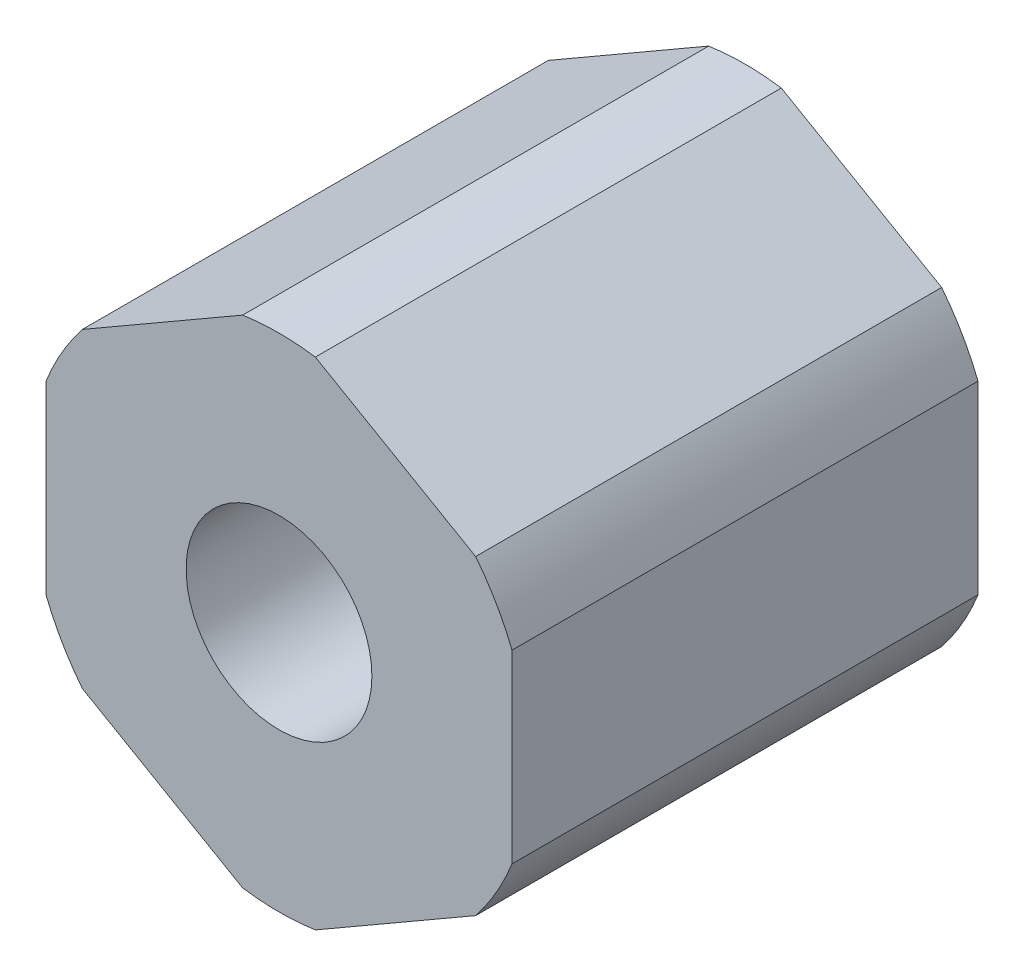
ISO-10303-21;
HEADER;
FILE_DESCRIPTION(('STEP AP214'),'2;1');
FILE_NAME('part.step','',(''),(''),'','','');
FILE_SCHEMA(('AUTOMOTIVE_DESIGN { 1 0 10303 214 1 1 1 1 }'));
ENDSEC;
DATA;
#1=APPLICATION_CONTEXT('core data for automotive mechanical design processes');
#2=APPLICATION_PROTOCOL_DEFINITION('international standard','automotive_design',2000,#1);
#3=PRODUCT_CONTEXT('',#1,'mechanical');
#4=PRODUCT('Part','Part','',(#3));
#5=PRODUCT_RELATED_PRODUCT_CATEGORY('part','',(#4));
#6=PRODUCT_DEFINITION_FORMATION('','',#4);
#7=PRODUCT_DEFINITION_CONTEXT('part definition',#1,'design');
#8=PRODUCT_DEFINITION('design','',#6,#7);
#9=PRODUCT_DEFINITION_SHAPE('','',#8);
#10=(LENGTH_UNIT() NAMED_UNIT(*) SI_UNIT(.MILLI.,.METRE.));
#11=(NAMED_UNIT(*) PLANE_ANGLE_UNIT() SI_UNIT($,.RADIAN.));
#12=(NAMED_UNIT(*) SI_UNIT($,.STERADIAN.) SOLID_ANGLE_UNIT());
#13=UNCERTAINTY_MEASURE_WITH_UNIT(LENGTH_MEASURE(1.E-05),#10,'distance_accuracy_value','');
#14=(GEOMETRIC_REPRESENTATION_CONTEXT(3) GLOBAL_UNCERTAINTY_ASSIGNED_CONTEXT((#13)) GLOBAL_UNIT_ASSIGNED_CONTEXT((#10,
#11,#12)) REPRESENTATION_CONTEXT('',''));
#15=CARTESIAN_POINT('',(0.,0.,0.));
#16=DIRECTION('',(0.,0.,1.));
#17=DIRECTION('',(1.,0.,0.));
#18=AXIS2_PLACEMENT_3D('',#15,#16,#17);
#19=CARTESIAN_POINT('',(0.,0.,4.7625));
#20=DIRECTION('',(0.,0.,1.));
#21=DIRECTION('',(1.,0.,0.));
#22=AXIS2_PLACEMENT_3D('',#19,#20,#21);
#23=PLANE('',#22);
#24=CARTESIAN_POINT('',(0.,0.,4.7625));
#25=DIRECTION('',(0.,0.,1.));
#26=DIRECTION('',(1.,0.,0.));
#27=AXIS2_PLACEMENT_3D('',#24,#25,#26);
#28=CIRCLE('',#27,1.89865);
#29=CARTESIAN_POINT('',(1.89865,0.,4.7625));
#30=VERTEX_POINT('',#29);
#31=EDGE_CURVE('E255',#30,#30,#28,.T.);
#32=ORIENTED_EDGE('',*,*,#31,.F.);
#33=EDGE_LOOP('',(#32));
#34=FACE_BOUND('',#33,.T.);
#35=CARTESIAN_POINT('',(0.,0.,4.7625));
#36=DIRECTION('',(0.,0.,1.));
#37=DIRECTION('',(1.,0.,0.));
#38=AXIS2_PLACEMENT_3D('',#35,#36,#37);
#39=CIRCLE('',#38,5.12445);
#40=CARTESIAN_POINT('',(4.01952231081252,-3.17858902586987,4.7625));
#41=VERTEX_POINT('',#40);
#42=CARTESIAN_POINT('',(4.7625,-1.89171391930704,4.7625));
#43=VERTEX_POINT('',#42);
#44=EDGE_CURVE('E138',#41,#43,#39,.T.);
#45=ORIENTED_EDGE('',*,*,#44,.T.);
#46=DIRECTION('',(0.,1.,0.));
#47=VECTOR('',#46,1.);
#48=CARTESIAN_POINT('',(4.7625,-1.89171391930704,4.7625));
#49=LINE('',#48,#47);
#50=CARTESIAN_POINT('',(4.7625,1.89171391930704,4.7625));
#51=VERTEX_POINT('',#50);
#52=EDGE_CURVE('E132',#43,#51,#49,.T.);
#53=ORIENTED_EDGE('',*,*,#52,.T.);
#54=CARTESIAN_POINT('',(0.,0.,4.7625));
#55=DIRECTION('',(0.,0.,1.));
#56=DIRECTION('',(1.,0.,0.));
#57=AXIS2_PLACEMENT_3D('',#54,#55,#56);
#58=CIRCLE('',#57,5.12445);
#59=CARTESIAN_POINT('',(4.01952231081252,3.17858902586987,4.7625));
#60=VERTEX_POINT('',#59);
#61=EDGE_CURVE('E135',#51,#60,#58,.T.);
#62=ORIENTED_EDGE('',*,*,#61,.T.);
#63=DIRECTION('',(-0.866025403784439,0.499999999999999,0.));
#64=VECTOR('',#63,1.);
#65=CARTESIAN_POINT('',(4.01952231081252,3.17858902586987,4.7625));
#66=LINE('',#65,#64);
#67=CARTESIAN_POINT('',(0.742977689187476,5.07030294517691,4.7625));
#68=VERTEX_POINT('',#67);
#69=EDGE_CURVE('E54',#60,#68,#66,.T.);
#70=ORIENTED_EDGE('',*,*,#69,.T.);
#71=CARTESIAN_POINT('',(0.,0.,4.7625));
#72=DIRECTION('',(0.,0.,1.));
#73=DIRECTION('',(1.,0.,0.));
#74=AXIS2_PLACEMENT_3D('',#71,#72,#73);
#75=CIRCLE('',#74,5.12445);
#76=CARTESIAN_POINT('',(-0.742977689187481,5.07030294517691,4.7625));
#77=VERTEX_POINT('',#76);
#78=EDGE_CURVE('E185',#68,#77,#75,.T.);
#79=ORIENTED_EDGE('',*,*,#78,.T.);
#80=DIRECTION('',(-0.866025403784438,-0.5,0.));
#81=VECTOR('',#80,1.);
#82=CARTESIAN_POINT('',(-0.742977689187481,5.07030294517691,4.7625));
#83=LINE('',#82,#81);
#84=CARTESIAN_POINT('',(-4.01952231081252,3.17858902586987,4.7625));
#85=VERTEX_POINT('',#84);
#86=EDGE_CURVE('E107',#77,#85,#83,.T.);
#87=ORIENTED_EDGE('',*,*,#86,.T.);
#88=CARTESIAN_POINT('',(0.,0.,4.7625));
#89=DIRECTION('',(0.,0.,1.));
#90=DIRECTION('',(1.,0.,0.));
#91=AXIS2_PLACEMENT_3D('',#88,#89,#90);
#92=CIRCLE('',#91,5.12445);
#93=CARTESIAN_POINT('',(-4.7625,1.89171391930704,4.7625));
#94=VERTEX_POINT('',#93);
#95=EDGE_CURVE('E212',#85,#94,#92,.T.);
#96=ORIENTED_EDGE('',*,*,#95,.T.);
#97=DIRECTION('',(0.,-1.,0.));
#98=VECTOR('',#97,1.);
#99=CARTESIAN_POINT('',(-4.7625,1.89171391930704,4.7625));
#100=LINE('',#99,#98);
#101=CARTESIAN_POINT('',(-4.7625,-1.89171391930704,4.7625));
#102=VERTEX_POINT('',#101);
#103=EDGE_CURVE('E226',#94,#102,#100,.T.);
#104=ORIENTED_EDGE('',*,*,#103,.T.);
#105=CARTESIAN_POINT('',(0.,0.,4.7625));
#106=DIRECTION('',(0.,0.,1.));
#107=DIRECTION('',(1.,0.,0.));
#108=AXIS2_PLACEMENT_3D('',#105,#106,#107);
#109=CIRCLE('',#108,5.12445);
#110=CARTESIAN_POINT('',(-4.01952231081252,-3.17858902586987,4.7625));
#111=VERTEX_POINT('',#110);
#112=EDGE_CURVE('E223',#102,#111,#109,.T.);
#113=ORIENTED_EDGE('',*,*,#112,.T.);
#114=DIRECTION('',(0.866025403784439,-0.5,0.));
#115=VECTOR('',#114,1.);
#116=CARTESIAN_POINT('',(-4.01952231081252,-3.17858902586987,4.7625));
#117=LINE('',#116,#115);
#118=CARTESIAN_POINT('',(-0.742977689187477,-5.07030294517691,4.7625));
#119=VERTEX_POINT('',#118);
#120=EDGE_CURVE('E225',#111,#119,#117,.T.);
#121=ORIENTED_EDGE('',*,*,#120,.T.);
#122=CARTESIAN_POINT('',(0.,0.,4.7625));
#123=DIRECTION('',(0.,0.,1.));
#124=DIRECTION('',(1.,0.,0.));
#125=AXIS2_PLACEMENT_3D('',#122,#123,#124);
#126=CIRCLE('',#125,5.12445);
#127=CARTESIAN_POINT('',(0.742977689187474,-5.07030294517691,4.7625));
#128=VERTEX_POINT('',#127);
#129=EDGE_CURVE('E228',#119,#128,#126,.T.);
#130=ORIENTED_EDGE('',*,*,#129,.T.);
#131=DIRECTION('',(0.866025403784439,0.5,0.));
#132=VECTOR('',#131,1.);
#133=CARTESIAN_POINT('',(0.742977689187478,-5.07030294517691,4.7625));
#134=LINE('',#133,#132);
#135=EDGE_CURVE('E234',#128,#41,#134,.T.);
#136=ORIENTED_EDGE('',*,*,#135,.T.);
#137=EDGE_LOOP('',(#45,#53,#62,#70,#79,#87,#96,#104,#113,#121,#130,#136));
#138=FACE_BOUND('',#137,.T.);
#139=ADVANCED_FACE('F38',(#34,#138),#23,.T.);
#140=CARTESIAN_POINT('',(-0.742977689187481,5.07030294517691,4.7625));
#141=DIRECTION('',(0.500000000000001,-0.866025403784438,0.));
#142=DIRECTION('',(0.866025403784438,0.500000000000001,0.));
#143=AXIS2_PLACEMENT_3D('',#140,#141,#142);
#144=PLANE('',#143);
#145=DIRECTION('',(0.,0.,-1.));
#146=VECTOR('',#145,1.);
#147=CARTESIAN_POINT('',(-4.01952231081252,3.17858902586987,4.7625));
#148=LINE('',#147,#146);
#149=CARTESIAN_POINT('',(-4.01952231081252,3.17858902586987,-4.7625));
#150=VERTEX_POINT('',#149);
#151=EDGE_CURVE('E46',#85,#150,#148,.T.);
#152=ORIENTED_EDGE('',*,*,#151,.F.);
#153=ORIENTED_EDGE('',*,*,#86,.F.);
#154=DIRECTION('',(0.,0.,-1.));
#155=VECTOR('',#154,1.);
#156=CARTESIAN_POINT('',(-0.742977689187481,5.07030294517691,4.7625));
#157=LINE('',#156,#155);
#158=CARTESIAN_POINT('',(-0.742977689187481,5.07030294517691,-4.7625));
#159=VERTEX_POINT('',#158);
#160=EDGE_CURVE('E11',#77,#159,#157,.T.);
#161=ORIENTED_EDGE('',*,*,#160,.T.);
#162=DIRECTION('',(-0.866025403784438,-0.5,0.));
#163=VECTOR('',#162,1.);
#164=CARTESIAN_POINT('',(-0.742977689187481,5.07030294517691,-4.7625));
#165=LINE('',#164,#163);
#166=EDGE_CURVE('E160',#159,#150,#165,.T.);
#167=ORIENTED_EDGE('',*,*,#166,.T.);
#168=EDGE_LOOP('',(#152,#153,#161,#167));
#169=FACE_BOUND('',#168,.T.);
#170=ADVANCED_FACE('F262',(#169),#144,.F.);
#171=CARTESIAN_POINT('',(-4.7625,1.89171391930704,4.7625));
#172=DIRECTION('',(1.,0.,0.));
#173=DIRECTION('',(0.,0.,-1.));
#174=AXIS2_PLACEMENT_3D('',#171,#172,#173);
#175=PLANE('',#174);
#176=DIRECTION('',(0.,0.,-1.));
#177=VECTOR('',#176,1.);
#178=CARTESIAN_POINT('',(-4.7625,-1.89171391930704,4.7625));
#179=LINE('',#178,#177);
#180=CARTESIAN_POINT('',(-4.7625,-1.89171391930704,-4.7625));
#181=VERTEX_POINT('',#180);
#182=EDGE_CURVE('E201',#102,#181,#179,.T.);
#183=ORIENTED_EDGE('',*,*,#182,.F.);
#184=ORIENTED_EDGE('',*,*,#103,.F.);
#185=DIRECTION('',(0.,0.,-1.));
#186=VECTOR('',#185,1.);
#187=CARTESIAN_POINT('',(-4.7625,1.89171391930704,4.7625));
#188=LINE('',#187,#186);
#189=CARTESIAN_POINT('',(-4.7625,1.89171391930704,-4.7625));
#190=VERTEX_POINT('',#189);
#191=EDGE_CURVE('E204',#94,#190,#188,.T.);
#192=ORIENTED_EDGE('',*,*,#191,.T.);
#193=DIRECTION('',(0.,-1.,0.));
#194=VECTOR('',#193,1.);
#195=CARTESIAN_POINT('',(-4.7625,1.89171391930704,-4.7625));
#196=LINE('',#195,#194);
#197=EDGE_CURVE('E166',#190,#181,#196,.T.);
#198=ORIENTED_EDGE('',*,*,#197,.T.);
#199=EDGE_LOOP('',(#183,#184,#192,#198));
#200=FACE_BOUND('',#199,.T.);
#201=ADVANCED_FACE('F217',(#200),#175,.F.);
#202=CARTESIAN_POINT('',(-4.01952231081252,-3.17858902586987,4.7625));
#203=DIRECTION('',(0.5,0.866025403784439,0.));
#204=DIRECTION('',(-0.866025403784438,0.5,0.));
#205=AXIS2_PLACEMENT_3D('',#202,#203,#204);
#206=PLANE('',#205);
#207=DIRECTION('',(0.,0.,-1.));
#208=VECTOR('',#207,1.);
#209=CARTESIAN_POINT('',(-0.742977689187477,-5.07030294517691,4.7625));
#210=LINE('',#209,#208);
#211=CARTESIAN_POINT('',(-0.742977689187477,-5.07030294517691,-4.7625));
#212=VERTEX_POINT('',#211);
#213=EDGE_CURVE('E195',#119,#212,#210,.T.);
#214=ORIENTED_EDGE('',*,*,#213,.F.);
#215=ORIENTED_EDGE('',*,*,#120,.F.);
#216=DIRECTION('',(0.,0.,-1.));
#217=VECTOR('',#216,1.);
#218=CARTESIAN_POINT('',(-4.01952231081252,-3.17858902586987,4.7625));
#219=LINE('',#218,#217);
#220=CARTESIAN_POINT('',(-4.01952231081252,-3.17858902586987,-4.7625));
#221=VERTEX_POINT('',#220);
#222=EDGE_CURVE('E198',#111,#221,#219,.T.);
#223=ORIENTED_EDGE('',*,*,#222,.T.);
#224=DIRECTION('',(0.866025403784439,-0.5,0.));
#225=VECTOR('',#224,1.);
#226=CARTESIAN_POINT('',(-4.01952231081252,-3.17858902586987,-4.7625));
#227=LINE('',#226,#225);
#228=EDGE_CURVE('E171',#221,#212,#227,.T.);
#229=ORIENTED_EDGE('',*,*,#228,.T.);
#230=EDGE_LOOP('',(#214,#215,#223,#229));
#231=FACE_BOUND('',#230,.T.);
#232=ADVANCED_FACE('F270',(#231),#206,.F.);
#233=CARTESIAN_POINT('',(0.742977689187478,-5.07030294517691,4.7625));
#234=DIRECTION('',(-0.5,0.866025403784439,0.));
#235=DIRECTION('',(-0.866025403784439,-0.5,0.));
#236=AXIS2_PLACEMENT_3D('',#233,#234,#235);
#237=PLANE('',#236);
#238=DIRECTION('',(0.,0.,-1.));
#239=VECTOR('',#238,1.);
#240=CARTESIAN_POINT('',(4.01952231081252,-3.17858902586987,4.7625));
#241=LINE('',#240,#239);
#242=CARTESIAN_POINT('',(4.01952231081252,-3.17858902586987,-4.7625));
#243=VERTEX_POINT('',#242);
#244=EDGE_CURVE('E189',#41,#243,#241,.T.);
#245=ORIENTED_EDGE('',*,*,#244,.F.);
#246=ORIENTED_EDGE('',*,*,#135,.F.);
#247=DIRECTION('',(0.,0.,-1.));
#248=VECTOR('',#247,1.);
#249=CARTESIAN_POINT('',(0.742977689187474,-5.07030294517691,4.7625));
#250=LINE('',#249,#248);
#251=CARTESIAN_POINT('',(0.742977689187474,-5.07030294517691,-4.7625));
#252=VERTEX_POINT('',#251);
#253=EDGE_CURVE('E192',#128,#252,#250,.T.);
#254=ORIENTED_EDGE('',*,*,#253,.T.);
#255=DIRECTION('',(0.866025403784439,0.5,0.));
#256=VECTOR('',#255,1.);
#257=CARTESIAN_POINT('',(0.742977689187478,-5.07030294517691,-4.7625));
#258=LINE('',#257,#256);
#259=EDGE_CURVE('E176',#252,#243,#258,.T.);
#260=ORIENTED_EDGE('',*,*,#259,.T.);
#261=EDGE_LOOP('',(#245,#246,#254,#260));
#262=FACE_BOUND('',#261,.T.);
#263=ADVANCED_FACE('F240',(#262),#237,.F.);
#264=CARTESIAN_POINT('',(4.7625,-1.89171391930704,4.7625));
#265=DIRECTION('',(-1.,0.,0.));
#266=DIRECTION('',(0.,0.,1.));
#267=AXIS2_PLACEMENT_3D('',#264,#265,#266);
#268=PLANE('',#267);
#269=ORIENTED_EDGE('',*,*,#52,.F.);
#270=DIRECTION('',(0.,0.,-1.));
#271=VECTOR('',#270,1.);
#272=CARTESIAN_POINT('',(4.7625,-1.89171391930704,4.7625));
#273=LINE('',#272,#271);
#274=CARTESIAN_POINT('',(4.7625,-1.89171391930704,-4.7625));
#275=VERTEX_POINT('',#274);
#276=EDGE_CURVE('E148',#43,#275,#273,.T.);
#277=ORIENTED_EDGE('',*,*,#276,.T.);
#278=DIRECTION('',(0.,1.,0.));
#279=VECTOR('',#278,1.);
#280=CARTESIAN_POINT('',(4.7625,-1.89171391930704,-4.7625));
#281=LINE('',#280,#279);
#282=CARTESIAN_POINT('',(4.7625,1.89171391930704,-4.7625));
#283=VERTEX_POINT('',#282);
#284=EDGE_CURVE('E146',#275,#283,#281,.T.);
#285=ORIENTED_EDGE('',*,*,#284,.T.);
#286=DIRECTION('',(0.,0.,-1.));
#287=VECTOR('',#286,1.);
#288=CARTESIAN_POINT('',(4.7625,1.89171391930704,4.7625));
#289=LINE('',#288,#287);
#290=EDGE_CURVE('E144',#51,#283,#289,.T.);
#291=ORIENTED_EDGE('',*,*,#290,.F.);
#292=EDGE_LOOP('',(#269,#277,#285,#291));
#293=FACE_BOUND('',#292,.T.);
#294=ADVANCED_FACE('F145',(#293),#268,.F.);
#295=CARTESIAN_POINT('',(4.01952231081252,3.17858902586987,4.7625));
#296=DIRECTION('',(-0.499999999999999,-0.866025403784439,0.));
#297=DIRECTION('',(0.866025403784439,-0.499999999999999,0.));
#298=AXIS2_PLACEMENT_3D('',#295,#296,#297);
#299=PLANE('',#298);
#300=DIRECTION('',(0.,0.,-1.));
#301=VECTOR('',#300,1.);
#302=CARTESIAN_POINT('',(0.742977689187476,5.07030294517691,4.7625));
#303=LINE('',#302,#301);
#304=CARTESIAN_POINT('',(0.742977689187476,5.07030294517691,-4.7625));
#305=VERTEX_POINT('',#304);
#306=EDGE_CURVE('E153',#68,#305,#303,.T.);
#307=ORIENTED_EDGE('',*,*,#306,.F.);
#308=ORIENTED_EDGE('',*,*,#69,.F.);
#309=DIRECTION('',(0.,0.,-1.));
#310=VECTOR('',#309,1.);
#311=CARTESIAN_POINT('',(4.01952231081252,3.17858902586987,4.7625));
#312=LINE('',#311,#310);
#313=CARTESIAN_POINT('',(4.01952231081252,3.17858902586987,-4.7625));
#314=VERTEX_POINT('',#313);
#315=EDGE_CURVE('E149',#60,#314,#312,.T.);
#316=ORIENTED_EDGE('',*,*,#315,.T.);
#317=DIRECTION('',(-0.866025403784439,0.499999999999999,0.));
#318=VECTOR('',#317,1.);
#319=CARTESIAN_POINT('',(4.01952231081252,3.17858902586987,-4.7625));
#320=LINE('',#319,#318);
#321=EDGE_CURVE('E95',#314,#305,#320,.T.);
#322=ORIENTED_EDGE('',*,*,#321,.T.);
#323=EDGE_LOOP('',(#307,#308,#316,#322));
#324=FACE_BOUND('',#323,.T.);
#325=ADVANCED_FACE('F245',(#324),#299,.F.);
#326=CARTESIAN_POINT('',(0.,0.,4.7625));
#327=DIRECTION('',(0.,0.,-1.));
#328=DIRECTION('',(-1.,0.,0.));
#329=AXIS2_PLACEMENT_3D('',#326,#327,#328);
#330=CYLINDRICAL_SURFACE('',#329,5.12445);
#331=CARTESIAN_POINT('',(0.,0.,-4.7625));
#332=DIRECTION('',(0.,0.,1.));
#333=DIRECTION('',(1.,0.,0.));
#334=AXIS2_PLACEMENT_3D('',#331,#332,#333);
#335=CIRCLE('',#334,5.12445);
#336=EDGE_CURVE('E157',#305,#159,#335,.T.);
#337=ORIENTED_EDGE('',*,*,#336,.T.);
#338=ORIENTED_EDGE('',*,*,#160,.F.);
#339=ORIENTED_EDGE('',*,*,#78,.F.);
#340=ORIENTED_EDGE('',*,*,#306,.T.);
#341=EDGE_LOOP('',(#337,#338,#339,#340));
#342=FACE_BOUND('',#341,.T.);
#343=ADVANCED_FACE('F249',(#342),#330,.T.);
#344=CARTESIAN_POINT('',(0.,0.,4.7625));
#345=DIRECTION('',(0.,0.,-1.));
#346=DIRECTION('',(-1.,0.,0.));
#347=AXIS2_PLACEMENT_3D('',#344,#345,#346);
#348=CYLINDRICAL_SURFACE('',#347,5.12445);
#349=CARTESIAN_POINT('',(0.,0.,-4.7625));
#350=DIRECTION('',(0.,0.,1.));
#351=DIRECTION('',(1.,0.,0.));
#352=AXIS2_PLACEMENT_3D('',#349,#350,#351);
#353=CIRCLE('',#352,5.12445);
#354=EDGE_CURVE('E163',#150,#190,#353,.T.);
#355=ORIENTED_EDGE('',*,*,#354,.T.);
#356=ORIENTED_EDGE('',*,*,#191,.F.);
#357=ORIENTED_EDGE('',*,*,#95,.F.);
#358=ORIENTED_EDGE('',*,*,#151,.T.);
#359=EDGE_LOOP('',(#355,#356,#357,#358));
#360=FACE_BOUND('',#359,.T.);
#361=ADVANCED_FACE('F210',(#360),#348,.T.);
#362=CARTESIAN_POINT('',(0.,0.,4.7625));
#363=DIRECTION('',(0.,0.,-1.));
#364=DIRECTION('',(-1.,0.,0.));
#365=AXIS2_PLACEMENT_3D('',#362,#363,#364);
#366=CYLINDRICAL_SURFACE('',#365,5.12445);
#367=CARTESIAN_POINT('',(0.,0.,-4.7625));
#368=DIRECTION('',(0.,0.,1.));
#369=DIRECTION('',(1.,0.,0.));
#370=AXIS2_PLACEMENT_3D('',#367,#368,#369);
#371=CIRCLE('',#370,5.12445);
#372=EDGE_CURVE('E168',#181,#221,#371,.T.);
#373=ORIENTED_EDGE('',*,*,#372,.T.);
#374=ORIENTED_EDGE('',*,*,#222,.F.);
#375=ORIENTED_EDGE('',*,*,#112,.F.);
#376=ORIENTED_EDGE('',*,*,#182,.T.);
#377=EDGE_LOOP('',(#373,#374,#375,#376));
#378=FACE_BOUND('',#377,.T.);
#379=ADVANCED_FACE('F221',(#378),#366,.T.);
#380=CARTESIAN_POINT('',(0.,0.,4.7625));
#381=DIRECTION('',(0.,0.,-1.));
#382=DIRECTION('',(-1.,0.,0.));
#383=AXIS2_PLACEMENT_3D('',#380,#381,#382);
#384=CYLINDRICAL_SURFACE('',#383,5.12445);
#385=CARTESIAN_POINT('',(0.,0.,-4.7625));
#386=DIRECTION('',(0.,0.,1.));
#387=DIRECTION('',(1.,0.,0.));
#388=AXIS2_PLACEMENT_3D('',#385,#386,#387);
#389=CIRCLE('',#388,5.12445);
#390=EDGE_CURVE('E173',#212,#252,#389,.T.);
#391=ORIENTED_EDGE('',*,*,#390,.T.);
#392=ORIENTED_EDGE('',*,*,#253,.F.);
#393=ORIENTED_EDGE('',*,*,#129,.F.);
#394=ORIENTED_EDGE('',*,*,#213,.T.);
#395=EDGE_LOOP('',(#391,#392,#393,#394));
#396=FACE_BOUND('',#395,.T.);
#397=ADVANCED_FACE('F288',(#396),#384,.T.);
#398=CARTESIAN_POINT('',(0.,0.,4.7625));
#399=DIRECTION('',(0.,0.,-1.));
#400=DIRECTION('',(-1.,0.,0.));
#401=AXIS2_PLACEMENT_3D('',#398,#399,#400);
#402=CYLINDRICAL_SURFACE('',#401,5.12445);
#403=CARTESIAN_POINT('',(0.,0.,-4.7625));
#404=DIRECTION('',(0.,0.,1.));
#405=DIRECTION('',(1.,0.,0.));
#406=AXIS2_PLACEMENT_3D('',#403,#404,#405);
#407=CIRCLE('',#406,5.12445);
#408=EDGE_CURVE('E178',#243,#275,#407,.T.);
#409=ORIENTED_EDGE('',*,*,#408,.T.);
#410=ORIENTED_EDGE('',*,*,#276,.F.);
#411=ORIENTED_EDGE('',*,*,#44,.F.);
#412=ORIENTED_EDGE('',*,*,#244,.T.);
#413=EDGE_LOOP('',(#409,#410,#411,#412));
#414=FACE_BOUND('',#413,.T.);
#415=ADVANCED_FACE('F243',(#414),#402,.T.);
#416=CARTESIAN_POINT('',(0.,0.,4.7625));
#417=DIRECTION('',(0.,0.,-1.));
#418=DIRECTION('',(-1.,0.,0.));
#419=AXIS2_PLACEMENT_3D('',#416,#417,#418);
#420=CYLINDRICAL_SURFACE('',#419,5.12445);
#421=CARTESIAN_POINT('',(0.,0.,-4.7625));
#422=DIRECTION('',(0.,0.,1.));
#423=DIRECTION('',(1.,0.,0.));
#424=AXIS2_PLACEMENT_3D('',#421,#422,#423);
#425=CIRCLE('',#424,5.12445);
#426=EDGE_CURVE('E182',#283,#314,#425,.T.);
#427=ORIENTED_EDGE('',*,*,#426,.T.);
#428=ORIENTED_EDGE('',*,*,#315,.F.);
#429=ORIENTED_EDGE('',*,*,#61,.F.);
#430=ORIENTED_EDGE('',*,*,#290,.T.);
#431=EDGE_LOOP('',(#427,#428,#429,#430));
#432=FACE_BOUND('',#431,.T.);
#433=ADVANCED_FACE('F151',(#432),#420,.T.);
#434=CARTESIAN_POINT('',(0.,0.,-4.7625));
#435=DIRECTION('',(0.,0.,1.));
#436=DIRECTION('',(1.,0.,0.));
#437=AXIS2_PLACEMENT_3D('',#434,#435,#436);
#438=PLANE('',#437);
#439=CARTESIAN_POINT('',(0.,0.,-4.7625));
#440=DIRECTION('',(0.,0.,1.));
#441=DIRECTION('',(1.,0.,0.));
#442=AXIS2_PLACEMENT_3D('',#439,#440,#441);
#443=CIRCLE('',#442,1.89865);
#444=CARTESIAN_POINT('',(1.89865,0.,-4.7625));
#445=VERTEX_POINT('',#444);
#446=EDGE_CURVE('E161',#445,#445,#443,.T.);
#447=ORIENTED_EDGE('',*,*,#446,.T.);
#448=EDGE_LOOP('',(#447));
#449=FACE_BOUND('',#448,.T.);
#450=ORIENTED_EDGE('',*,*,#321,.F.);
#451=ORIENTED_EDGE('',*,*,#426,.F.);
#452=ORIENTED_EDGE('',*,*,#284,.F.);
#453=ORIENTED_EDGE('',*,*,#408,.F.);
#454=ORIENTED_EDGE('',*,*,#259,.F.);
#455=ORIENTED_EDGE('',*,*,#390,.F.);
#456=ORIENTED_EDGE('',*,*,#228,.F.);
#457=ORIENTED_EDGE('',*,*,#372,.F.);
#458=ORIENTED_EDGE('',*,*,#197,.F.);
#459=ORIENTED_EDGE('',*,*,#354,.F.);
#460=ORIENTED_EDGE('',*,*,#166,.F.);
#461=ORIENTED_EDGE('',*,*,#336,.F.);
#462=EDGE_LOOP('',(#450,#451,#452,#453,#454,#455,#456,#457,#458,#459,#460,#461));
#463=FACE_BOUND('',#462,.T.);
#464=ADVANCED_FACE('F213',(#449,#463),#438,.F.);
#465=CARTESIAN_POINT('',(0.,0.,-4.7625));
#466=DIRECTION('',(0.,0.,1.));
#467=DIRECTION('',(1.,0.,0.));
#468=AXIS2_PLACEMENT_3D('',#465,#466,#467);
#469=CYLINDRICAL_SURFACE('',#468,1.89865);
#470=ORIENTED_EDGE('',*,*,#446,.F.);
#471=EDGE_LOOP('',(#470));
#472=FACE_BOUND('',#471,.T.);
#473=ORIENTED_EDGE('',*,*,#31,.T.);
#474=EDGE_LOOP('',(#473));
#475=FACE_BOUND('',#474,.T.);
#476=ADVANCED_FACE('F259',(#472,#475),#469,.F.);
#477=CLOSED_SHELL('',(#139,#170,#201,#232,#263,#294,#325,#343,#361,#379,#397,#415,#433,#464,#476));
#478=MANIFOLD_SOLID_BREP('B2',#477);
#479=ADVANCED_BREP_SHAPE_REPRESENTATION('',(#18,#478),#14);
#480=SHAPE_DEFINITION_REPRESENTATION(#9,#479);
ENDSEC;
END-ISO-10303-21;
